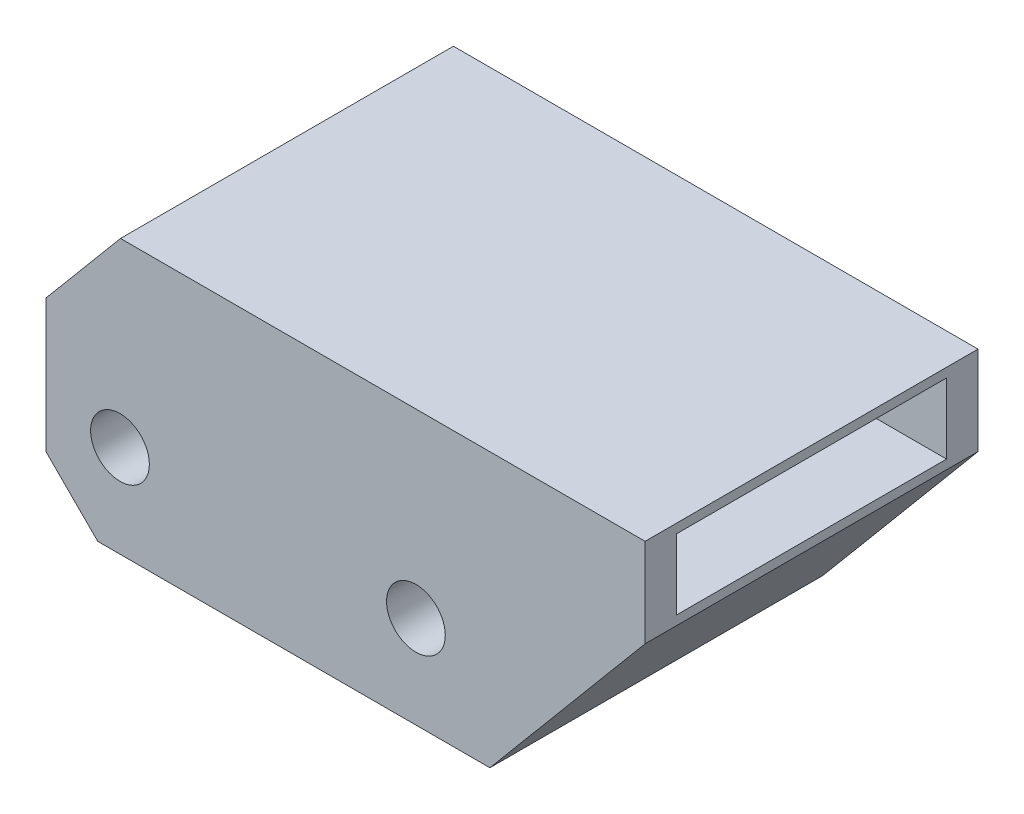
ISO-10303-21;
HEADER;
FILE_DESCRIPTION(('STEP AP214'),'2;1');
FILE_NAME('part.step','',(''),(''),'','','');
FILE_SCHEMA(('AUTOMOTIVE_DESIGN { 1 0 10303 214 1 1 1 1 }'));
ENDSEC;
DATA;
#1=APPLICATION_CONTEXT('core data for automotive mechanical design processes');
#2=APPLICATION_PROTOCOL_DEFINITION('international standard','automotive_design',2000,#1);
#3=PRODUCT_CONTEXT('',#1,'mechanical');
#4=PRODUCT('Part','Part','',(#3));
#5=PRODUCT_RELATED_PRODUCT_CATEGORY('part','',(#4));
#6=PRODUCT_DEFINITION_FORMATION('','',#4);
#7=PRODUCT_DEFINITION_CONTEXT('part definition',#1,'design');
#8=PRODUCT_DEFINITION('design','',#6,#7);
#9=PRODUCT_DEFINITION_SHAPE('','',#8);
#10=(LENGTH_UNIT() NAMED_UNIT(*) SI_UNIT(.MILLI.,.METRE.));
#11=(NAMED_UNIT(*) PLANE_ANGLE_UNIT() SI_UNIT($,.RADIAN.));
#12=(NAMED_UNIT(*) SI_UNIT($,.STERADIAN.) SOLID_ANGLE_UNIT());
#13=UNCERTAINTY_MEASURE_WITH_UNIT(LENGTH_MEASURE(1.E-05),#10,'distance_accuracy_value','');
#14=(GEOMETRIC_REPRESENTATION_CONTEXT(3) GLOBAL_UNCERTAINTY_ASSIGNED_CONTEXT((#13)) GLOBAL_UNIT_ASSIGNED_CONTEXT((#10,
#11,#12)) REPRESENTATION_CONTEXT('',''));
#15=CARTESIAN_POINT('',(0.,0.,0.));
#16=DIRECTION('',(0.,0.,1.));
#17=DIRECTION('',(1.,0.,0.));
#18=AXIS2_PLACEMENT_3D('',#15,#16,#17);
#19=CARTESIAN_POINT('',(0.,0.,22.5));
#20=DIRECTION('',(0.,0.,-1.));
#21=DIRECTION('',(-1.,0.,0.));
#22=AXIS2_PLACEMENT_3D('',#19,#20,#21);
#23=PLANE('',#22);
#24=DIRECTION('',(0.,-1.,0.));
#25=VECTOR('',#24,1.);
#26=CARTESIAN_POINT('',(-30.,-12.5,22.5));
#27=LINE('',#26,#25);
#28=CARTESIAN_POINT('',(-30.,12.5,22.5));
#29=VERTEX_POINT('',#28);
#30=CARTESIAN_POINT('',(-30.,-5.49999999999998,22.5));
#31=VERTEX_POINT('',#30);
#32=EDGE_CURVE('E179',#29,#31,#27,.T.);
#33=ORIENTED_EDGE('',*,*,#32,.T.);
#34=DIRECTION('',(-0.707106781186546,0.707106781186549,0.));
#35=VECTOR('',#34,1.);
#36=CARTESIAN_POINT('',(-23.,-12.5,22.5));
#37=LINE('',#36,#35);
#38=CARTESIAN_POINT('',(-23.,-12.5,22.5));
#39=VERTEX_POINT('',#38);
#40=EDGE_CURVE('E11',#31,#39,#37,.F.);
#41=ORIENTED_EDGE('',*,*,#40,.T.);
#42=DIRECTION('',(1.,0.,0.));
#43=VECTOR('',#42,1.);
#44=CARTESIAN_POINT('',(30.,-12.5,22.5));
#45=LINE('',#44,#43);
#46=CARTESIAN_POINT('',(30.,-12.5,22.5));
#47=VERTEX_POINT('',#46);
#48=EDGE_CURVE('E182',#39,#47,#45,.T.);
#49=ORIENTED_EDGE('',*,*,#48,.T.);
#50=DIRECTION('',(0.64278760968654,0.766044443118977,0.));
#51=VECTOR('',#50,1.);
#52=CARTESIAN_POINT('',(50.9774907794321,12.5,22.5));
#53=LINE('',#52,#51);
#54=CARTESIAN_POINT('',(50.9774907794321,12.5,22.5));
#55=VERTEX_POINT('',#54);
#56=EDGE_CURVE('E184',#47,#55,#53,.T.);
#57=ORIENTED_EDGE('',*,*,#56,.T.);
#58=DIRECTION('',(0.,1.,0.));
#59=VECTOR('',#58,1.);
#60=CARTESIAN_POINT('',(50.9774907794321,24.5,22.5));
#61=LINE('',#60,#59);
#62=CARTESIAN_POINT('',(50.9774907794321,24.5,22.5));
#63=VERTEX_POINT('',#62);
#64=EDGE_CURVE('E186',#55,#63,#61,.T.);
#65=ORIENTED_EDGE('',*,*,#64,.T.);
#66=DIRECTION('',(-1.,0.,0.));
#67=VECTOR('',#66,1.);
#68=CARTESIAN_POINT('',(30.9774907794321,24.5,22.5));
#69=LINE('',#68,#67);
#70=CARTESIAN_POINT('',(-19.9308044258725,24.5,22.5));
#71=VERTEX_POINT('',#70);
#72=EDGE_CURVE('E188',#63,#71,#69,.T.);
#73=ORIENTED_EDGE('',*,*,#72,.T.);
#74=DIRECTION('',(-0.642787609686544,-0.766044443118975,0.));
#75=VECTOR('',#74,1.);
#76=CARTESIAN_POINT('',(-19.9308044258725,24.5,22.5));
#77=LINE('',#76,#75);
#78=EDGE_CURVE('E176',#71,#29,#77,.T.);
#79=ORIENTED_EDGE('',*,*,#78,.T.);
#80=EDGE_LOOP('',(#33,#41,#49,#57,#65,#73,#79));
#81=FACE_BOUND('',#80,.T.);
#82=CARTESIAN_POINT('',(-20.,0.,22.5));
#83=DIRECTION('',(0.,0.,1.));
#84=DIRECTION('',(1.,0.,0.));
#85=AXIS2_PLACEMENT_3D('',#82,#83,#84);
#86=CIRCLE('',#85,3.97);
#87=CARTESIAN_POINT('',(-16.03,0.,22.5));
#88=VERTEX_POINT('',#87);
#89=EDGE_CURVE('E170',#88,#88,#86,.T.);
#90=ORIENTED_EDGE('',*,*,#89,.F.);
#91=EDGE_LOOP('',(#90));
#92=FACE_BOUND('',#91,.T.);
#93=CARTESIAN_POINT('',(20.,0.,22.5));
#94=DIRECTION('',(0.,0.,1.));
#95=DIRECTION('',(1.,0.,0.));
#96=AXIS2_PLACEMENT_3D('',#93,#94,#95);
#97=CIRCLE('',#96,3.97);
#98=CARTESIAN_POINT('',(23.97,0.,22.5));
#99=VERTEX_POINT('',#98);
#100=EDGE_CURVE('E164',#99,#99,#97,.T.);
#101=ORIENTED_EDGE('',*,*,#100,.F.);
#102=EDGE_LOOP('',(#101));
#103=FACE_BOUND('',#102,.T.);
#104=ADVANCED_FACE('F40',(#81,#92,#103),#23,.F.);
#105=CARTESIAN_POINT('',(0.,0.,-22.5));
#106=DIRECTION('',(0.,0.,-1.));
#107=DIRECTION('',(-1.,0.,0.));
#108=AXIS2_PLACEMENT_3D('',#105,#106,#107);
#109=PLANE('',#108);
#110=CARTESIAN_POINT('',(-20.,0.,-22.5));
#111=DIRECTION('',(0.,0.,1.));
#112=DIRECTION('',(1.,0.,0.));
#113=AXIS2_PLACEMENT_3D('',#110,#111,#112);
#114=CIRCLE('',#113,3.97);
#115=CARTESIAN_POINT('',(-16.03,0.,-22.5));
#116=VERTEX_POINT('',#115);
#117=EDGE_CURVE('E167',#116,#116,#114,.T.);
#118=ORIENTED_EDGE('',*,*,#117,.T.);
#119=EDGE_LOOP('',(#118));
#120=FACE_BOUND('',#119,.T.);
#121=DIRECTION('',(1.,0.,0.));
#122=VECTOR('',#121,1.);
#123=CARTESIAN_POINT('',(30.,-12.5,-22.5));
#124=LINE('',#123,#122);
#125=CARTESIAN_POINT('',(-23.,-12.5,-22.5));
#126=VERTEX_POINT('',#125);
#127=CARTESIAN_POINT('',(30.,-12.5,-22.5));
#128=VERTEX_POINT('',#127);
#129=EDGE_CURVE('E195',#126,#128,#124,.T.);
#130=ORIENTED_EDGE('',*,*,#129,.F.);
#131=DIRECTION('',(0.707106781186546,-0.707106781186549,0.));
#132=VECTOR('',#131,1.);
#133=CARTESIAN_POINT('',(-17.75,-17.75,-22.5));
#134=LINE('',#133,#132);
#135=CARTESIAN_POINT('',(-30.,-5.49999999999998,-22.5));
#136=VERTEX_POINT('',#135);
#137=EDGE_CURVE('E62',#126,#136,#134,.F.);
#138=ORIENTED_EDGE('',*,*,#137,.T.);
#139=DIRECTION('',(0.,-1.,0.));
#140=VECTOR('',#139,1.);
#141=CARTESIAN_POINT('',(-30.,-12.5,-22.5));
#142=LINE('',#141,#140);
#143=CARTESIAN_POINT('',(-30.,12.5,-22.5));
#144=VERTEX_POINT('',#143);
#145=EDGE_CURVE('E193',#144,#136,#142,.T.);
#146=ORIENTED_EDGE('',*,*,#145,.F.);
#147=DIRECTION('',(-0.642787609686544,-0.766044443118975,0.));
#148=VECTOR('',#147,1.);
#149=CARTESIAN_POINT('',(-19.9308044258725,24.5,-22.5));
#150=LINE('',#149,#148);
#151=CARTESIAN_POINT('',(-19.9308044258725,24.5,-22.5));
#152=VERTEX_POINT('',#151);
#153=EDGE_CURVE('E173',#152,#144,#150,.T.);
#154=ORIENTED_EDGE('',*,*,#153,.F.);
#155=DIRECTION('',(-1.,0.,0.));
#156=VECTOR('',#155,1.);
#157=CARTESIAN_POINT('',(30.9774907794321,24.5,-22.5));
#158=LINE('',#157,#156);
#159=CARTESIAN_POINT('',(50.9774907794321,24.5,-22.5));
#160=VERTEX_POINT('',#159);
#161=EDGE_CURVE('E180',#160,#152,#158,.T.);
#162=ORIENTED_EDGE('',*,*,#161,.F.);
#163=DIRECTION('',(0.,1.,0.));
#164=VECTOR('',#163,1.);
#165=CARTESIAN_POINT('',(50.9774907794321,24.5,-22.5));
#166=LINE('',#165,#164);
#167=CARTESIAN_POINT('',(50.9774907794321,12.5,-22.5));
#168=VERTEX_POINT('',#167);
#169=EDGE_CURVE('E199',#168,#160,#166,.T.);
#170=ORIENTED_EDGE('',*,*,#169,.F.);
#171=DIRECTION('',(0.64278760968654,0.766044443118977,0.));
#172=VECTOR('',#171,1.);
#173=CARTESIAN_POINT('',(50.9774907794321,12.5,-22.5));
#174=LINE('',#173,#172);
#175=EDGE_CURVE('E197',#128,#168,#174,.T.);
#176=ORIENTED_EDGE('',*,*,#175,.F.);
#177=EDGE_LOOP('',(#130,#138,#146,#154,#162,#170,#176));
#178=FACE_BOUND('',#177,.T.);
#179=CARTESIAN_POINT('',(20.,0.,-22.5));
#180=DIRECTION('',(0.,0.,1.));
#181=DIRECTION('',(1.,0.,0.));
#182=AXIS2_PLACEMENT_3D('',#179,#180,#181);
#183=CIRCLE('',#182,3.97);
#184=CARTESIAN_POINT('',(23.97,0.,-22.5));
#185=VERTEX_POINT('',#184);
#186=EDGE_CURVE('E160',#185,#185,#183,.T.);
#187=ORIENTED_EDGE('',*,*,#186,.T.);
#188=EDGE_LOOP('',(#187));
#189=FACE_BOUND('',#188,.T.);
#190=ADVANCED_FACE('F228',(#120,#178,#189),#109,.T.);
#191=CARTESIAN_POINT('',(-19.9308044258725,24.5,22.5));
#192=DIRECTION('',(0.766044443118974,-0.642787609686543,0.));
#193=DIRECTION('',(0.642787609686544,0.766044443118975,0.));
#194=AXIS2_PLACEMENT_3D('',#191,#192,#193);
#195=PLANE('',#194);
#196=ORIENTED_EDGE('',*,*,#153,.T.);
#197=DIRECTION('',(0.,0.,-1.));
#198=VECTOR('',#197,1.);
#199=CARTESIAN_POINT('',(-30.,12.5,22.5));
#200=LINE('',#199,#198);
#201=EDGE_CURVE('E214',#29,#144,#200,.T.);
#202=ORIENTED_EDGE('',*,*,#201,.F.);
#203=ORIENTED_EDGE('',*,*,#78,.F.);
#204=DIRECTION('',(0.,0.,-1.));
#205=VECTOR('',#204,1.);
#206=CARTESIAN_POINT('',(-19.9308044258725,24.5,22.5));
#207=LINE('',#206,#205);
#208=EDGE_CURVE('E190',#71,#152,#207,.T.);
#209=ORIENTED_EDGE('',*,*,#208,.T.);
#210=EDGE_LOOP('',(#196,#202,#203,#209));
#211=FACE_BOUND('',#210,.T.);
#212=ADVANCED_FACE('F253',(#211),#195,.F.);
#213=CARTESIAN_POINT('',(-30.,-12.5,22.5));
#214=DIRECTION('',(1.,0.,0.));
#215=DIRECTION('',(0.,0.,-1.));
#216=AXIS2_PLACEMENT_3D('',#213,#214,#215);
#217=PLANE('',#216);
#218=ORIENTED_EDGE('',*,*,#145,.T.);
#219=DIRECTION('',(0.,0.,1.));
#220=VECTOR('',#219,1.);
#221=CARTESIAN_POINT('',(-30.,-5.49999999999998,22.5));
#222=LINE('',#221,#220);
#223=EDGE_CURVE('E48',#136,#31,#222,.T.);
#224=ORIENTED_EDGE('',*,*,#223,.T.);
#225=ORIENTED_EDGE('',*,*,#32,.F.);
#226=ORIENTED_EDGE('',*,*,#201,.T.);
#227=EDGE_LOOP('',(#218,#224,#225,#226));
#228=FACE_BOUND('',#227,.T.);
#229=ADVANCED_FACE('F271',(#228),#217,.F.);
#230=CARTESIAN_POINT('',(30.,-12.5,22.5));
#231=DIRECTION('',(0.,1.,0.));
#232=DIRECTION('',(0.,0.,1.));
#233=AXIS2_PLACEMENT_3D('',#230,#231,#232);
#234=PLANE('',#233);
#235=ORIENTED_EDGE('',*,*,#48,.F.);
#236=DIRECTION('',(0.,0.,-1.));
#237=VECTOR('',#236,1.);
#238=CARTESIAN_POINT('',(-23.,-12.5,22.5));
#239=LINE('',#238,#237);
#240=EDGE_CURVE('E217',#39,#126,#239,.T.);
#241=ORIENTED_EDGE('',*,*,#240,.T.);
#242=ORIENTED_EDGE('',*,*,#129,.T.);
#243=DIRECTION('',(0.,0.,-1.));
#244=VECTOR('',#243,1.);
#245=CARTESIAN_POINT('',(30.,-12.5,22.5));
#246=LINE('',#245,#244);
#247=EDGE_CURVE('E211',#47,#128,#246,.T.);
#248=ORIENTED_EDGE('',*,*,#247,.F.);
#249=EDGE_LOOP('',(#235,#241,#242,#248));
#250=FACE_BOUND('',#249,.T.);
#251=ADVANCED_FACE('F223',(#250),#234,.F.);
#252=CARTESIAN_POINT('',(50.9774907794321,12.5,22.5));
#253=DIRECTION('',(-0.766044443118977,0.64278760968654,0.));
#254=DIRECTION('',(-0.64278760968654,-0.766044443118977,0.));
#255=AXIS2_PLACEMENT_3D('',#252,#253,#254);
#256=PLANE('',#255);
#257=ORIENTED_EDGE('',*,*,#175,.T.);
#258=DIRECTION('',(0.,0.,-1.));
#259=VECTOR('',#258,1.);
#260=CARTESIAN_POINT('',(50.9774907794321,12.5,22.5));
#261=LINE('',#260,#259);
#262=EDGE_CURVE('E208',#55,#168,#261,.T.);
#263=ORIENTED_EDGE('',*,*,#262,.F.);
#264=ORIENTED_EDGE('',*,*,#56,.F.);
#265=ORIENTED_EDGE('',*,*,#247,.T.);
#266=EDGE_LOOP('',(#257,#263,#264,#265));
#267=FACE_BOUND('',#266,.T.);
#268=ADVANCED_FACE('F233',(#267),#256,.F.);
#269=CARTESIAN_POINT('',(50.9774907794321,24.5,22.5));
#270=DIRECTION('',(-1.,0.,0.));
#271=DIRECTION('',(0.,-1.,0.));
#272=AXIS2_PLACEMENT_3D('',#269,#270,#271);
#273=PLANE('',#272);
#274=DIRECTION('',(0.,0.,-1.));
#275=VECTOR('',#274,1.);
#276=CARTESIAN_POINT('',(50.9774907794321,13.75,-18.25));
#277=LINE('',#276,#275);
#278=CARTESIAN_POINT('',(50.9774907794321,13.75,18.25));
#279=VERTEX_POINT('',#278);
#280=CARTESIAN_POINT('',(50.9774907794321,13.75,-18.25));
#281=VERTEX_POINT('',#280);
#282=EDGE_CURVE('E154',#279,#281,#277,.T.);
#283=ORIENTED_EDGE('',*,*,#282,.F.);
#284=DIRECTION('',(0.,-1.,0.));
#285=VECTOR('',#284,1.);
#286=CARTESIAN_POINT('',(50.9774907794321,13.75,18.25));
#287=LINE('',#286,#285);
#288=CARTESIAN_POINT('',(50.9774907794321,23.25,18.25));
#289=VERTEX_POINT('',#288);
#290=EDGE_CURVE('E128',#289,#279,#287,.T.);
#291=ORIENTED_EDGE('',*,*,#290,.F.);
#292=DIRECTION('',(0.,0.,1.));
#293=VECTOR('',#292,1.);
#294=CARTESIAN_POINT('',(50.9774907794321,23.25,-18.25));
#295=LINE('',#294,#293);
#296=CARTESIAN_POINT('',(50.9774907794321,23.25,-18.25));
#297=VERTEX_POINT('',#296);
#298=EDGE_CURVE('E145',#297,#289,#295,.T.);
#299=ORIENTED_EDGE('',*,*,#298,.F.);
#300=DIRECTION('',(0.,1.,0.));
#301=VECTOR('',#300,1.);
#302=CARTESIAN_POINT('',(50.9774907794321,13.75,-18.25));
#303=LINE('',#302,#301);
#304=EDGE_CURVE('E148',#281,#297,#303,.T.);
#305=ORIENTED_EDGE('',*,*,#304,.F.);
#306=EDGE_LOOP('',(#283,#291,#299,#305));
#307=FACE_BOUND('',#306,.T.);
#308=ORIENTED_EDGE('',*,*,#169,.T.);
#309=DIRECTION('',(0.,0.,-1.));
#310=VECTOR('',#309,1.);
#311=CARTESIAN_POINT('',(50.9774907794321,24.5,22.5));
#312=LINE('',#311,#310);
#313=EDGE_CURVE('E205',#63,#160,#312,.T.);
#314=ORIENTED_EDGE('',*,*,#313,.F.);
#315=ORIENTED_EDGE('',*,*,#64,.F.);
#316=ORIENTED_EDGE('',*,*,#262,.T.);
#317=EDGE_LOOP('',(#308,#314,#315,#316));
#318=FACE_BOUND('',#317,.T.);
#319=ADVANCED_FACE('F237',(#307,#318),#273,.F.);
#320=CARTESIAN_POINT('',(30.9774907794321,24.5,22.5));
#321=DIRECTION('',(0.,-1.,0.));
#322=DIRECTION('',(1.,0.,0.));
#323=AXIS2_PLACEMENT_3D('',#320,#321,#322);
#324=PLANE('',#323);
#325=ORIENTED_EDGE('',*,*,#161,.T.);
#326=ORIENTED_EDGE('',*,*,#208,.F.);
#327=ORIENTED_EDGE('',*,*,#72,.F.);
#328=ORIENTED_EDGE('',*,*,#313,.T.);
#329=EDGE_LOOP('',(#325,#326,#327,#328));
#330=FACE_BOUND('',#329,.T.);
#331=ADVANCED_FACE('F260',(#330),#324,.F.);
#332=CARTESIAN_POINT('',(-20.,0.,22.5));
#333=DIRECTION('',(0.,0.,-1.));
#334=DIRECTION('',(-1.,0.,0.));
#335=AXIS2_PLACEMENT_3D('',#332,#333,#334);
#336=CYLINDRICAL_SURFACE('',#335,3.97);
#337=ORIENTED_EDGE('',*,*,#89,.T.);
#338=EDGE_LOOP('',(#337));
#339=FACE_BOUND('',#338,.T.);
#340=ORIENTED_EDGE('',*,*,#117,.F.);
#341=EDGE_LOOP('',(#340));
#342=FACE_BOUND('',#341,.T.);
#343=ADVANCED_FACE('F257',(#339,#342),#336,.F.);
#344=CARTESIAN_POINT('',(20.,0.,22.5));
#345=DIRECTION('',(0.,0.,-1.));
#346=DIRECTION('',(-1.,0.,0.));
#347=AXIS2_PLACEMENT_3D('',#344,#345,#346);
#348=CYLINDRICAL_SURFACE('',#347,3.97);
#349=ORIENTED_EDGE('',*,*,#100,.T.);
#350=EDGE_LOOP('',(#349));
#351=FACE_BOUND('',#350,.T.);
#352=ORIENTED_EDGE('',*,*,#186,.F.);
#353=EDGE_LOOP('',(#352));
#354=FACE_BOUND('',#353,.T.);
#355=ADVANCED_FACE('F312',(#351,#354),#348,.F.);
#356=CARTESIAN_POINT('',(25.9774907794321,13.75,18.25));
#357=DIRECTION('',(0.,0.,1.));
#358=DIRECTION('',(1.,0.,0.));
#359=AXIS2_PLACEMENT_3D('',#356,#357,#358);
#360=PLANE('',#359);
#361=ORIENTED_EDGE('',*,*,#290,.T.);
#362=DIRECTION('',(1.,0.,0.));
#363=VECTOR('',#362,1.);
#364=CARTESIAN_POINT('',(25.9774907794321,13.75,18.25));
#365=LINE('',#364,#363);
#366=CARTESIAN_POINT('',(25.9774907794321,13.75,18.25));
#367=VERTEX_POINT('',#366);
#368=EDGE_CURVE('E121',#367,#279,#365,.T.);
#369=ORIENTED_EDGE('',*,*,#368,.F.);
#370=DIRECTION('',(0.,-1.,0.));
#371=VECTOR('',#370,1.);
#372=CARTESIAN_POINT('',(25.9774907794321,13.75,18.25));
#373=LINE('',#372,#371);
#374=CARTESIAN_POINT('',(25.9774907794321,23.25,18.25));
#375=VERTEX_POINT('',#374);
#376=EDGE_CURVE('E125',#375,#367,#373,.T.);
#377=ORIENTED_EDGE('',*,*,#376,.F.);
#378=DIRECTION('',(1.,0.,0.));
#379=VECTOR('',#378,1.);
#380=CARTESIAN_POINT('',(25.9774907794321,23.25,18.25));
#381=LINE('',#380,#379);
#382=EDGE_CURVE('E158',#375,#289,#381,.T.);
#383=ORIENTED_EDGE('',*,*,#382,.T.);
#384=EDGE_LOOP('',(#361,#369,#377,#383));
#385=FACE_BOUND('',#384,.T.);
#386=ADVANCED_FACE('F123',(#385),#360,.F.);
#387=CARTESIAN_POINT('',(25.9774907794321,23.25,-18.25));
#388=DIRECTION('',(0.,1.,0.));
#389=DIRECTION('',(-1.,0.,0.));
#390=AXIS2_PLACEMENT_3D('',#387,#388,#389);
#391=PLANE('',#390);
#392=ORIENTED_EDGE('',*,*,#298,.T.);
#393=ORIENTED_EDGE('',*,*,#382,.F.);
#394=DIRECTION('',(0.,0.,1.));
#395=VECTOR('',#394,1.);
#396=CARTESIAN_POINT('',(25.9774907794321,23.25,-18.25));
#397=LINE('',#396,#395);
#398=CARTESIAN_POINT('',(25.9774907794321,23.25,-18.25));
#399=VERTEX_POINT('',#398);
#400=EDGE_CURVE('E133',#399,#375,#397,.T.);
#401=ORIENTED_EDGE('',*,*,#400,.F.);
#402=DIRECTION('',(1.,0.,0.));
#403=VECTOR('',#402,1.);
#404=CARTESIAN_POINT('',(25.9774907794321,23.25,-18.25));
#405=LINE('',#404,#403);
#406=EDGE_CURVE('E161',#399,#297,#405,.T.);
#407=ORIENTED_EDGE('',*,*,#406,.T.);
#408=EDGE_LOOP('',(#392,#393,#401,#407));
#409=FACE_BOUND('',#408,.T.);
#410=ADVANCED_FACE('F323',(#409),#391,.F.);
#411=CARTESIAN_POINT('',(25.9774907794321,13.75,-18.25));
#412=DIRECTION('',(0.,0.,-1.));
#413=DIRECTION('',(-1.,0.,0.));
#414=AXIS2_PLACEMENT_3D('',#411,#412,#413);
#415=PLANE('',#414);
#416=ORIENTED_EDGE('',*,*,#304,.T.);
#417=ORIENTED_EDGE('',*,*,#406,.F.);
#418=DIRECTION('',(0.,1.,0.));
#419=VECTOR('',#418,1.);
#420=CARTESIAN_POINT('',(25.9774907794321,13.75,-18.25));
#421=LINE('',#420,#419);
#422=CARTESIAN_POINT('',(25.9774907794321,13.75,-18.25));
#423=VERTEX_POINT('',#422);
#424=EDGE_CURVE('E141',#423,#399,#421,.T.);
#425=ORIENTED_EDGE('',*,*,#424,.F.);
#426=DIRECTION('',(1.,0.,0.));
#427=VECTOR('',#426,1.);
#428=CARTESIAN_POINT('',(25.9774907794321,13.75,-18.25));
#429=LINE('',#428,#427);
#430=EDGE_CURVE('E132',#423,#281,#429,.T.);
#431=ORIENTED_EDGE('',*,*,#430,.T.);
#432=EDGE_LOOP('',(#416,#417,#425,#431));
#433=FACE_BOUND('',#432,.T.);
#434=ADVANCED_FACE('F330',(#433),#415,.F.);
#435=CARTESIAN_POINT('',(25.9774907794321,13.75,-18.25));
#436=DIRECTION('',(0.,-1.,0.));
#437=DIRECTION('',(1.,0.,0.));
#438=AXIS2_PLACEMENT_3D('',#435,#436,#437);
#439=PLANE('',#438);
#440=ORIENTED_EDGE('',*,*,#282,.T.);
#441=ORIENTED_EDGE('',*,*,#430,.F.);
#442=DIRECTION('',(0.,0.,-1.));
#443=VECTOR('',#442,1.);
#444=CARTESIAN_POINT('',(25.9774907794321,13.75,-18.25));
#445=LINE('',#444,#443);
#446=EDGE_CURVE('E136',#367,#423,#445,.T.);
#447=ORIENTED_EDGE('',*,*,#446,.F.);
#448=ORIENTED_EDGE('',*,*,#368,.T.);
#449=EDGE_LOOP('',(#440,#441,#447,#448));
#450=FACE_BOUND('',#449,.T.);
#451=ADVANCED_FACE('F137',(#450),#439,.F.);
#452=CARTESIAN_POINT('',(25.977490779432,0.,0.));
#453=DIRECTION('',(1.,0.,0.));
#454=DIRECTION('',(0.,1.,0.));
#455=AXIS2_PLACEMENT_3D('',#452,#453,#454);
#456=PLANE('',#455);
#457=ORIENTED_EDGE('',*,*,#376,.T.);
#458=ORIENTED_EDGE('',*,*,#446,.T.);
#459=ORIENTED_EDGE('',*,*,#424,.T.);
#460=ORIENTED_EDGE('',*,*,#400,.T.);
#461=EDGE_LOOP('',(#457,#458,#459,#460));
#462=FACE_BOUND('',#461,.T.);
#463=ADVANCED_FACE('F143',(#462),#456,.T.);
#464=CARTESIAN_POINT('',(-23.,-12.5,22.5));
#465=DIRECTION('',(0.707106781186549,0.707106781186546,0.));
#466=DIRECTION('',(0.,0.,-1.));
#467=AXIS2_PLACEMENT_3D('',#464,#465,#466);
#468=PLANE('',#467);
#469=ORIENTED_EDGE('',*,*,#40,.F.);
#470=ORIENTED_EDGE('',*,*,#223,.F.);
#471=ORIENTED_EDGE('',*,*,#137,.F.);
#472=ORIENTED_EDGE('',*,*,#240,.F.);
#473=EDGE_LOOP('',(#469,#470,#471,#472));
#474=FACE_BOUND('',#473,.T.);
#475=ADVANCED_FACE('F42',(#474),#468,.F.);
#476=CLOSED_SHELL('',(#104,#190,#212,#229,#251,#268,#319,#331,#343,#355,#386,#410,#434,#451,
#463,#475));
#477=MANIFOLD_SOLID_BREP('B2',#476);
#478=ADVANCED_BREP_SHAPE_REPRESENTATION('',(#18,#477),#14);
#479=SHAPE_DEFINITION_REPRESENTATION(#9,#478);
ENDSEC;
END-ISO-10303-21;
